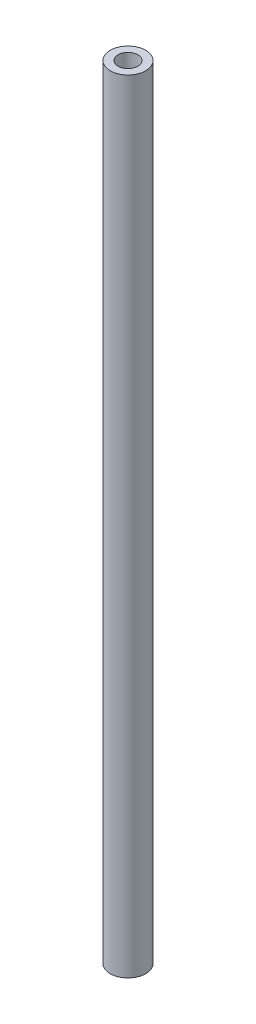
ISO-10303-21;
HEADER;
FILE_DESCRIPTION(('STEP AP214'),'2;1');
FILE_NAME('part.step','',(''),(''),'','','');
FILE_SCHEMA(('AUTOMOTIVE_DESIGN { 1 0 10303 214 1 1 1 1 }'));
ENDSEC;
DATA;
#1=APPLICATION_CONTEXT('core data for automotive mechanical design processes');
#2=APPLICATION_PROTOCOL_DEFINITION('international standard','automotive_design',2000,#1);
#3=PRODUCT_CONTEXT('',#1,'mechanical');
#4=PRODUCT('Part','Part','',(#3));
#5=PRODUCT_RELATED_PRODUCT_CATEGORY('part','',(#4));
#6=PRODUCT_DEFINITION_FORMATION('','',#4);
#7=PRODUCT_DEFINITION_CONTEXT('part definition',#1,'design');
#8=PRODUCT_DEFINITION('design','',#6,#7);
#9=PRODUCT_DEFINITION_SHAPE('','',#8);
#10=(LENGTH_UNIT() NAMED_UNIT(*) SI_UNIT(.MILLI.,.METRE.));
#11=(NAMED_UNIT(*) PLANE_ANGLE_UNIT() SI_UNIT($,.RADIAN.));
#12=(NAMED_UNIT(*) SI_UNIT($,.STERADIAN.) SOLID_ANGLE_UNIT());
#13=UNCERTAINTY_MEASURE_WITH_UNIT(LENGTH_MEASURE(1.E-05),#10,'distance_accuracy_value','');
#14=(GEOMETRIC_REPRESENTATION_CONTEXT(3) GLOBAL_UNCERTAINTY_ASSIGNED_CONTEXT((#13)) GLOBAL_UNIT_ASSIGNED_CONTEXT((#10,
#11,#12)) REPRESENTATION_CONTEXT('',''));
#15=CARTESIAN_POINT('',(0.,0.,0.));
#16=DIRECTION('',(0.,0.,1.));
#17=DIRECTION('',(1.,0.,0.));
#18=AXIS2_PLACEMENT_3D('',#15,#16,#17);
#19=CARTESIAN_POINT('',(0.,500.,0.));
#20=DIRECTION('',(0.,-1.,0.));
#21=DIRECTION('',(0.,0.,-1.));
#22=AXIS2_PLACEMENT_3D('',#19,#20,#21);
#23=CYLINDRICAL_SURFACE('',#22,11.35);
#24=CARTESIAN_POINT('',(0.,500.,0.));
#25=DIRECTION('',(0.,1.,0.));
#26=DIRECTION('',(0.,0.,1.));
#27=AXIS2_PLACEMENT_3D('',#24,#25,#26);
#28=CIRCLE('',#27,11.35);
#29=CARTESIAN_POINT('',(0.,500.,11.35));
#30=VERTEX_POINT('',#29);
#31=EDGE_CURVE('E10',#30,#30,#28,.T.);
#32=ORIENTED_EDGE('',*,*,#31,.F.);
#33=EDGE_LOOP('',(#32));
#34=FACE_BOUND('',#33,.T.);
#35=CARTESIAN_POINT('',(0.,0.,0.));
#36=DIRECTION('',(0.,1.,0.));
#37=DIRECTION('',(0.,0.,1.));
#38=AXIS2_PLACEMENT_3D('',#35,#36,#37);
#39=CIRCLE('',#38,11.35);
#40=CARTESIAN_POINT('',(0.,0.,11.35));
#41=VERTEX_POINT('',#40);
#42=EDGE_CURVE('E33',#41,#41,#39,.T.);
#43=ORIENTED_EDGE('',*,*,#42,.T.);
#44=EDGE_LOOP('',(#43));
#45=FACE_BOUND('',#44,.T.);
#46=ADVANCED_FACE('F30',(#34,#45),#23,.T.);
#47=CARTESIAN_POINT('',(0.,500.,0.));
#48=DIRECTION('',(0.,1.,0.));
#49=DIRECTION('',(0.,0.,1.));
#50=AXIS2_PLACEMENT_3D('',#47,#48,#49);
#51=PLANE('',#50);
#52=CARTESIAN_POINT('',(0.,500.,0.));
#53=DIRECTION('',(0.,-1.,0.));
#54=DIRECTION('',(0.,0.,-1.));
#55=AXIS2_PLACEMENT_3D('',#52,#53,#54);
#56=CIRCLE('',#55,6.34999999999995);
#57=CARTESIAN_POINT('',(0.,500.,-6.34999999999995));
#58=VERTEX_POINT('',#57);
#59=EDGE_CURVE('E40',#58,#58,#56,.T.);
#60=ORIENTED_EDGE('',*,*,#59,.T.);
#61=EDGE_LOOP('',(#60));
#62=FACE_BOUND('',#61,.T.);
#63=ORIENTED_EDGE('',*,*,#31,.T.);
#64=EDGE_LOOP('',(#63));
#65=FACE_BOUND('',#64,.T.);
#66=ADVANCED_FACE('F53',(#62,#65),#51,.T.);
#67=CARTESIAN_POINT('',(0.,0.,0.));
#68=DIRECTION('',(0.,1.,0.));
#69=DIRECTION('',(0.,0.,1.));
#70=AXIS2_PLACEMENT_3D('',#67,#68,#69);
#71=PLANE('',#70);
#72=CARTESIAN_POINT('',(0.,0.,0.));
#73=DIRECTION('',(0.,-1.,0.));
#74=DIRECTION('',(0.,0.,-1.));
#75=AXIS2_PLACEMENT_3D('',#72,#73,#74);
#76=CIRCLE('',#75,6.35000000000001);
#77=CARTESIAN_POINT('',(0.,0.,-6.35000000000001));
#78=VERTEX_POINT('',#77);
#79=EDGE_CURVE('E44',#78,#78,#76,.T.);
#80=ORIENTED_EDGE('',*,*,#79,.F.);
#81=EDGE_LOOP('',(#80));
#82=FACE_BOUND('',#81,.T.);
#83=ORIENTED_EDGE('',*,*,#42,.F.);
#84=EDGE_LOOP('',(#83));
#85=FACE_BOUND('',#84,.T.);
#86=ADVANCED_FACE('F50',(#82,#85),#71,.F.);
#87=CARTESIAN_POINT('',(0.,0.,0.));
#88=DIRECTION('',(0.,-1.,0.));
#89=DIRECTION('',(0.,0.,-1.));
#90=AXIS2_PLACEMENT_3D('',#87,#88,#89);
#91=CYLINDRICAL_SURFACE('',#90,6.34999999999998);
#92=ORIENTED_EDGE('',*,*,#59,.F.);
#93=EDGE_LOOP('',(#92));
#94=FACE_BOUND('',#93,.T.);
#95=ORIENTED_EDGE('',*,*,#79,.T.);
#96=EDGE_LOOP('',(#95));
#97=FACE_BOUND('',#96,.T.);
#98=ADVANCED_FACE('F48',(#94,#97),#91,.F.);
#99=CLOSED_SHELL('',(#46,#66,#86,#98));
#100=MANIFOLD_SOLID_BREP('B2',#99);
#101=ADVANCED_BREP_SHAPE_REPRESENTATION('',(#18,#100),#14);
#102=SHAPE_DEFINITION_REPRESENTATION(#9,#101);
ENDSEC;
END-ISO-10303-21;
